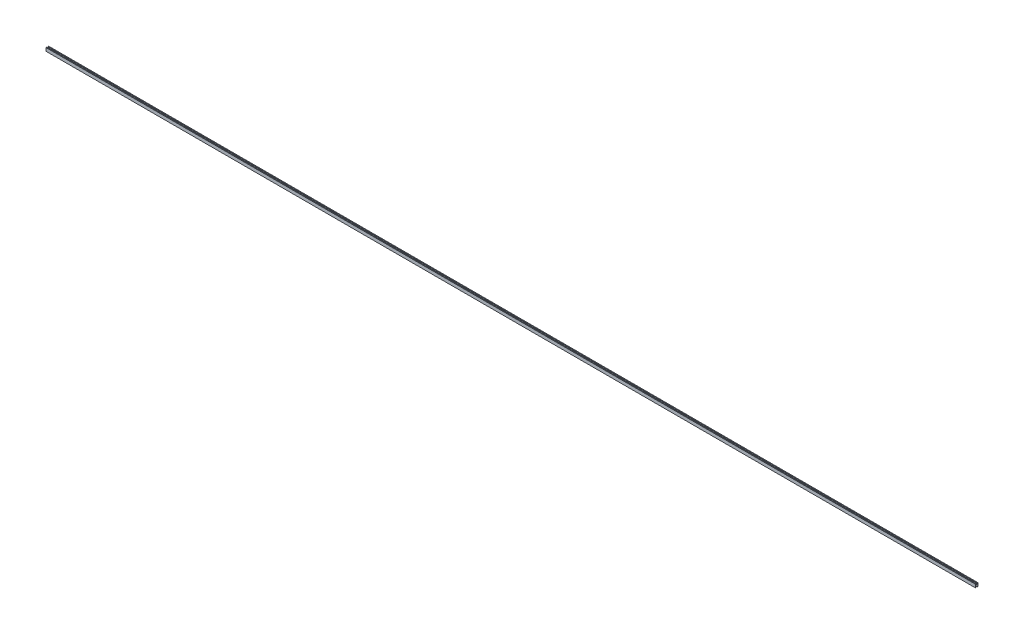
ISO-10303-21;
HEADER;
FILE_DESCRIPTION(('STEP AP214'),'2;1');
FILE_NAME('part.step','',(''),(''),'','','');
FILE_SCHEMA(('AUTOMOTIVE_DESIGN { 1 0 10303 214 1 1 1 1 }'));
ENDSEC;
DATA;
#1=APPLICATION_CONTEXT('core data for automotive mechanical design processes');
#2=APPLICATION_PROTOCOL_DEFINITION('international standard','automotive_design',2000,#1);
#3=PRODUCT_CONTEXT('',#1,'mechanical');
#4=PRODUCT('Part','Part','',(#3));
#5=PRODUCT_RELATED_PRODUCT_CATEGORY('part','',(#4));
#6=PRODUCT_DEFINITION_FORMATION('','',#4);
#7=PRODUCT_DEFINITION_CONTEXT('part definition',#1,'design');
#8=PRODUCT_DEFINITION('design','',#6,#7);
#9=PRODUCT_DEFINITION_SHAPE('','',#8);
#10=(LENGTH_UNIT() NAMED_UNIT(*) SI_UNIT(.MILLI.,.METRE.));
#11=(NAMED_UNIT(*) PLANE_ANGLE_UNIT() SI_UNIT($,.RADIAN.));
#12=(NAMED_UNIT(*) SI_UNIT($,.STERADIAN.) SOLID_ANGLE_UNIT());
#13=UNCERTAINTY_MEASURE_WITH_UNIT(LENGTH_MEASURE(1.E-05),#10,'distance_accuracy_value','');
#14=(GEOMETRIC_REPRESENTATION_CONTEXT(3) GLOBAL_UNCERTAINTY_ASSIGNED_CONTEXT((#13)) GLOBAL_UNIT_ASSIGNED_CONTEXT((#10,
#11,#12)) REPRESENTATION_CONTEXT('',''));
#15=CARTESIAN_POINT('',(0.,0.,0.));
#16=DIRECTION('',(0.,0.,1.));
#17=DIRECTION('',(1.,0.,0.));
#18=AXIS2_PLACEMENT_3D('',#15,#16,#17);
#19=CARTESIAN_POINT('',(9144.,15.875,12.7));
#20=DIRECTION('',(0.,1.,0.));
#21=DIRECTION('',(0.,0.,1.));
#22=AXIS2_PLACEMENT_3D('',#19,#20,#21);
#23=PLANE('',#22);
#24=DIRECTION('',(0.,0.,-1.));
#25=VECTOR('',#24,1.);
#26=CARTESIAN_POINT('',(0.,15.875,12.7));
#27=LINE('',#26,#25);
#28=CARTESIAN_POINT('',(0.,15.875,12.7));
#29=VERTEX_POINT('',#28);
#30=CARTESIAN_POINT('',(0.,15.875,5.08));
#31=VERTEX_POINT('',#30);
#32=EDGE_CURVE('E165',#29,#31,#27,.T.);
#33=ORIENTED_EDGE('',*,*,#32,.F.);
#34=DIRECTION('',(-1.,0.,0.));
#35=VECTOR('',#34,1.);
#36=CARTESIAN_POINT('',(9144.,15.875,12.7));
#37=LINE('',#36,#35);
#38=CARTESIAN_POINT('',(9144.,15.875,12.7));
#39=VERTEX_POINT('',#38);
#40=EDGE_CURVE('E11',#39,#29,#37,.T.);
#41=ORIENTED_EDGE('',*,*,#40,.F.);
#42=DIRECTION('',(0.,0.,-1.));
#43=VECTOR('',#42,1.);
#44=CARTESIAN_POINT('',(9144.,15.875,12.7));
#45=LINE('',#44,#43);
#46=CARTESIAN_POINT('',(9144.,15.875,5.08));
#47=VERTEX_POINT('',#46);
#48=EDGE_CURVE('E206',#39,#47,#45,.T.);
#49=ORIENTED_EDGE('',*,*,#48,.T.);
#50=DIRECTION('',(-1.,0.,0.));
#51=VECTOR('',#50,1.);
#52=CARTESIAN_POINT('',(9144.,15.875,5.08));
#53=LINE('',#52,#51);
#54=EDGE_CURVE('E42',#47,#31,#53,.T.);
#55=ORIENTED_EDGE('',*,*,#54,.T.);
#56=EDGE_LOOP('',(#33,#41,#49,#55));
#57=FACE_BOUND('',#56,.T.);
#58=ADVANCED_FACE('F39',(#57),#23,.T.);
#59=CARTESIAN_POINT('',(9144.,-15.875,12.7));
#60=DIRECTION('',(0.,0.,1.));
#61=DIRECTION('',(1.,0.,0.));
#62=AXIS2_PLACEMENT_3D('',#59,#60,#61);
#63=PLANE('',#62);
#64=DIRECTION('',(0.,1.,0.));
#65=VECTOR('',#64,1.);
#66=CARTESIAN_POINT('',(0.,-15.875,12.7));
#67=LINE('',#66,#65);
#68=CARTESIAN_POINT('',(0.,-15.875,12.7));
#69=VERTEX_POINT('',#68);
#70=EDGE_CURVE('E203',#69,#29,#67,.T.);
#71=ORIENTED_EDGE('',*,*,#70,.F.);
#72=DIRECTION('',(-1.,0.,0.));
#73=VECTOR('',#72,1.);
#74=CARTESIAN_POINT('',(9144.,-15.875,12.7));
#75=LINE('',#74,#73);
#76=CARTESIAN_POINT('',(9144.,-15.875,12.7));
#77=VERTEX_POINT('',#76);
#78=EDGE_CURVE('E49',#77,#69,#75,.T.);
#79=ORIENTED_EDGE('',*,*,#78,.F.);
#80=DIRECTION('',(0.,1.,0.));
#81=VECTOR('',#80,1.);
#82=CARTESIAN_POINT('',(9144.,-15.875,12.7));
#83=LINE('',#82,#81);
#84=EDGE_CURVE('E140',#77,#39,#83,.T.);
#85=ORIENTED_EDGE('',*,*,#84,.T.);
#86=ORIENTED_EDGE('',*,*,#40,.T.);
#87=EDGE_LOOP('',(#71,#79,#85,#86));
#88=FACE_BOUND('',#87,.T.);
#89=ADVANCED_FACE('F239',(#88),#63,.T.);
#90=CARTESIAN_POINT('',(9144.,-15.875,12.7));
#91=DIRECTION('',(0.,1.,0.));
#92=DIRECTION('',(0.,0.,1.));
#93=AXIS2_PLACEMENT_3D('',#90,#91,#92);
#94=PLANE('',#93);
#95=DIRECTION('',(0.,0.,-1.));
#96=VECTOR('',#95,1.);
#97=CARTESIAN_POINT('',(0.,-15.875,12.7));
#98=LINE('',#97,#96);
#99=CARTESIAN_POINT('',(0.,-15.875,5.08));
#100=VERTEX_POINT('',#99);
#101=EDGE_CURVE('E146',#69,#100,#98,.T.);
#102=ORIENTED_EDGE('',*,*,#101,.T.);
#103=DIRECTION('',(-1.,0.,0.));
#104=VECTOR('',#103,1.);
#105=CARTESIAN_POINT('',(9144.,-15.875,5.08));
#106=LINE('',#105,#104);
#107=CARTESIAN_POINT('',(9144.,-15.875,5.08));
#108=VERTEX_POINT('',#107);
#109=EDGE_CURVE('E144',#108,#100,#106,.T.);
#110=ORIENTED_EDGE('',*,*,#109,.F.);
#111=DIRECTION('',(0.,0.,-1.));
#112=VECTOR('',#111,1.);
#113=CARTESIAN_POINT('',(9144.,-15.875,12.7));
#114=LINE('',#113,#112);
#115=EDGE_CURVE('E134',#77,#108,#114,.T.);
#116=ORIENTED_EDGE('',*,*,#115,.F.);
#117=ORIENTED_EDGE('',*,*,#78,.T.);
#118=EDGE_LOOP('',(#102,#110,#116,#117));
#119=FACE_BOUND('',#118,.T.);
#120=ADVANCED_FACE('F145',(#119),#94,.F.);
#121=CARTESIAN_POINT('',(9144.,-15.875,5.08));
#122=DIRECTION('',(0.,0.,1.));
#123=DIRECTION('',(0.,-1.,0.));
#124=AXIS2_PLACEMENT_3D('',#121,#122,#123);
#125=PLANE('',#124);
#126=DIRECTION('',(0.,1.,0.));
#127=VECTOR('',#126,1.);
#128=CARTESIAN_POINT('',(0.,-15.875,5.08));
#129=LINE('',#128,#127);
#130=CARTESIAN_POINT('',(0.,-6.98499999999999,5.08));
#131=VERTEX_POINT('',#130);
#132=EDGE_CURVE('E198',#100,#131,#129,.T.);
#133=ORIENTED_EDGE('',*,*,#132,.T.);
#134=DIRECTION('',(-1.,0.,0.));
#135=VECTOR('',#134,1.);
#136=CARTESIAN_POINT('',(9144.,-6.98499999999999,5.08));
#137=LINE('',#136,#135);
#138=CARTESIAN_POINT('',(9144.,-6.98499999999999,5.08));
#139=VERTEX_POINT('',#138);
#140=EDGE_CURVE('E150',#139,#131,#137,.T.);
#141=ORIENTED_EDGE('',*,*,#140,.F.);
#142=DIRECTION('',(0.,1.,0.));
#143=VECTOR('',#142,1.);
#144=CARTESIAN_POINT('',(9144.,-15.875,5.08));
#145=LINE('',#144,#143);
#146=EDGE_CURVE('E138',#108,#139,#145,.T.);
#147=ORIENTED_EDGE('',*,*,#146,.F.);
#148=ORIENTED_EDGE('',*,*,#109,.T.);
#149=EDGE_LOOP('',(#133,#141,#147,#148));
#150=FACE_BOUND('',#149,.T.);
#151=ADVANCED_FACE('F152',(#150),#125,.F.);
#152=CARTESIAN_POINT('',(9144.,-6.98499999999999,5.08));
#153=DIRECTION('',(0.,1.,0.));
#154=DIRECTION('',(0.,0.,1.));
#155=AXIS2_PLACEMENT_3D('',#152,#153,#154);
#156=PLANE('',#155);
#157=DIRECTION('',(0.,0.,-1.));
#158=VECTOR('',#157,1.);
#159=CARTESIAN_POINT('',(0.,-6.98499999999999,5.08));
#160=LINE('',#159,#158);
#161=CARTESIAN_POINT('',(0.,-6.98499999999999,-5.08));
#162=VERTEX_POINT('',#161);
#163=EDGE_CURVE('E195',#131,#162,#160,.T.);
#164=ORIENTED_EDGE('',*,*,#163,.T.);
#165=DIRECTION('',(-1.,0.,0.));
#166=VECTOR('',#165,1.);
#167=CARTESIAN_POINT('',(9144.,-6.98499999999999,-5.08));
#168=LINE('',#167,#166);
#169=CARTESIAN_POINT('',(9144.,-6.98499999999999,-5.08));
#170=VERTEX_POINT('',#169);
#171=EDGE_CURVE('E212',#170,#162,#168,.T.);
#172=ORIENTED_EDGE('',*,*,#171,.F.);
#173=DIRECTION('',(0.,0.,-1.));
#174=VECTOR('',#173,1.);
#175=CARTESIAN_POINT('',(9144.,-6.98499999999999,5.08));
#176=LINE('',#175,#174);
#177=EDGE_CURVE('E156',#139,#170,#176,.T.);
#178=ORIENTED_EDGE('',*,*,#177,.F.);
#179=ORIENTED_EDGE('',*,*,#140,.T.);
#180=EDGE_LOOP('',(#164,#172,#178,#179));
#181=FACE_BOUND('',#180,.T.);
#182=ADVANCED_FACE('F252',(#181),#156,.F.);
#183=CARTESIAN_POINT('',(9144.,-6.98499999999999,-5.08));
#184=DIRECTION('',(0.,0.,-1.));
#185=DIRECTION('',(-1.,0.,0.));
#186=AXIS2_PLACEMENT_3D('',#183,#184,#185);
#187=PLANE('',#186);
#188=DIRECTION('',(0.,-1.,0.));
#189=VECTOR('',#188,1.);
#190=CARTESIAN_POINT('',(0.,-6.98499999999999,-5.08));
#191=LINE('',#190,#189);
#192=CARTESIAN_POINT('',(0.,-15.875,-5.08));
#193=VERTEX_POINT('',#192);
#194=EDGE_CURVE('E192',#162,#193,#191,.T.);
#195=ORIENTED_EDGE('',*,*,#194,.T.);
#196=DIRECTION('',(-1.,0.,0.));
#197=VECTOR('',#196,1.);
#198=CARTESIAN_POINT('',(9144.,-15.875,-5.08));
#199=LINE('',#198,#197);
#200=CARTESIAN_POINT('',(9144.,-15.875,-5.08));
#201=VERTEX_POINT('',#200);
#202=EDGE_CURVE('E216',#201,#193,#199,.T.);
#203=ORIENTED_EDGE('',*,*,#202,.F.);
#204=DIRECTION('',(0.,-1.,0.));
#205=VECTOR('',#204,1.);
#206=CARTESIAN_POINT('',(9144.,-6.98499999999999,-5.08));
#207=LINE('',#206,#205);
#208=EDGE_CURVE('E159',#170,#201,#207,.T.);
#209=ORIENTED_EDGE('',*,*,#208,.F.);
#210=ORIENTED_EDGE('',*,*,#171,.T.);
#211=EDGE_LOOP('',(#195,#203,#209,#210));
#212=FACE_BOUND('',#211,.T.);
#213=ADVANCED_FACE('F255',(#212),#187,.F.);
#214=CARTESIAN_POINT('',(9144.,-15.875,-5.08));
#215=DIRECTION('',(0.,1.,0.));
#216=DIRECTION('',(0.,0.,1.));
#217=AXIS2_PLACEMENT_3D('',#214,#215,#216);
#218=PLANE('',#217);
#219=DIRECTION('',(0.,0.,-1.));
#220=VECTOR('',#219,1.);
#221=CARTESIAN_POINT('',(0.,-15.875,-5.08));
#222=LINE('',#221,#220);
#223=CARTESIAN_POINT('',(0.,-15.875,-12.7));
#224=VERTEX_POINT('',#223);
#225=EDGE_CURVE('E189',#193,#224,#222,.T.);
#226=ORIENTED_EDGE('',*,*,#225,.T.);
#227=DIRECTION('',(-1.,0.,0.));
#228=VECTOR('',#227,1.);
#229=CARTESIAN_POINT('',(9144.,-15.875,-12.7));
#230=LINE('',#229,#228);
#231=CARTESIAN_POINT('',(9144.,-15.875,-12.7));
#232=VERTEX_POINT('',#231);
#233=EDGE_CURVE('E220',#232,#224,#230,.T.);
#234=ORIENTED_EDGE('',*,*,#233,.F.);
#235=DIRECTION('',(0.,0.,-1.));
#236=VECTOR('',#235,1.);
#237=CARTESIAN_POINT('',(9144.,-15.875,-5.08));
#238=LINE('',#237,#236);
#239=EDGE_CURVE('E383',#201,#232,#238,.T.);
#240=ORIENTED_EDGE('',*,*,#239,.F.);
#241=ORIENTED_EDGE('',*,*,#202,.T.);
#242=EDGE_LOOP('',(#226,#234,#240,#241));
#243=FACE_BOUND('',#242,.T.);
#244=ADVANCED_FACE('F259',(#243),#218,.F.);
#245=CARTESIAN_POINT('',(9144.,-15.875,-12.7));
#246=DIRECTION('',(0.,0.,1.));
#247=DIRECTION('',(1.,0.,0.));
#248=AXIS2_PLACEMENT_3D('',#245,#246,#247);
#249=PLANE('',#248);
#250=DIRECTION('',(0.,1.,0.));
#251=VECTOR('',#250,1.);
#252=CARTESIAN_POINT('',(0.,-15.875,-12.7));
#253=LINE('',#252,#251);
#254=CARTESIAN_POINT('',(0.,15.875,-12.7));
#255=VERTEX_POINT('',#254);
#256=EDGE_CURVE('E185',#224,#255,#253,.T.);
#257=ORIENTED_EDGE('',*,*,#256,.T.);
#258=DIRECTION('',(-1.,0.,0.));
#259=VECTOR('',#258,1.);
#260=CARTESIAN_POINT('',(9144.,15.875,-12.7));
#261=LINE('',#260,#259);
#262=CARTESIAN_POINT('',(9144.,15.875,-12.7));
#263=VERTEX_POINT('',#262);
#264=EDGE_CURVE('E224',#263,#255,#261,.T.);
#265=ORIENTED_EDGE('',*,*,#264,.F.);
#266=DIRECTION('',(0.,1.,0.));
#267=VECTOR('',#266,1.);
#268=CARTESIAN_POINT('',(9144.,-15.875,-12.7));
#269=LINE('',#268,#267);
#270=EDGE_CURVE('E388',#232,#263,#269,.T.);
#271=ORIENTED_EDGE('',*,*,#270,.F.);
#272=ORIENTED_EDGE('',*,*,#233,.T.);
#273=EDGE_LOOP('',(#257,#265,#271,#272));
#274=FACE_BOUND('',#273,.T.);
#275=ADVANCED_FACE('F263',(#274),#249,.F.);
#276=CARTESIAN_POINT('',(9144.,15.875,-5.08));
#277=DIRECTION('',(0.,1.,0.));
#278=DIRECTION('',(0.,0.,1.));
#279=AXIS2_PLACEMENT_3D('',#276,#277,#278);
#280=PLANE('',#279);
#281=DIRECTION('',(0.,0.,-1.));
#282=VECTOR('',#281,1.);
#283=CARTESIAN_POINT('',(0.,15.875,-5.08));
#284=LINE('',#283,#282);
#285=CARTESIAN_POINT('',(0.,15.875,-5.08));
#286=VERTEX_POINT('',#285);
#287=EDGE_CURVE('E181',#286,#255,#284,.T.);
#288=ORIENTED_EDGE('',*,*,#287,.F.);
#289=DIRECTION('',(-1.,0.,0.));
#290=VECTOR('',#289,1.);
#291=CARTESIAN_POINT('',(9144.,15.875,-5.08));
#292=LINE('',#291,#290);
#293=CARTESIAN_POINT('',(9144.,15.875,-5.08));
#294=VERTEX_POINT('',#293);
#295=EDGE_CURVE('E227',#294,#286,#292,.T.);
#296=ORIENTED_EDGE('',*,*,#295,.F.);
#297=DIRECTION('',(0.,0.,-1.));
#298=VECTOR('',#297,1.);
#299=CARTESIAN_POINT('',(9144.,15.875,-5.08));
#300=LINE('',#299,#298);
#301=EDGE_CURVE('E375',#294,#263,#300,.T.);
#302=ORIENTED_EDGE('',*,*,#301,.T.);
#303=ORIENTED_EDGE('',*,*,#264,.T.);
#304=EDGE_LOOP('',(#288,#296,#302,#303));
#305=FACE_BOUND('',#304,.T.);
#306=ADVANCED_FACE('F267',(#305),#280,.T.);
#307=CARTESIAN_POINT('',(9144.,6.98499999999999,-5.08));
#308=DIRECTION('',(0.,0.,1.));
#309=DIRECTION('',(1.,0.,0.));
#310=AXIS2_PLACEMENT_3D('',#307,#308,#309);
#311=PLANE('',#310);
#312=DIRECTION('',(0.,1.,0.));
#313=VECTOR('',#312,1.);
#314=CARTESIAN_POINT('',(0.,6.98499999999999,-5.08));
#315=LINE('',#314,#313);
#316=CARTESIAN_POINT('',(0.,6.98499999999999,-5.08));
#317=VERTEX_POINT('',#316);
#318=EDGE_CURVE('E177',#317,#286,#315,.T.);
#319=ORIENTED_EDGE('',*,*,#318,.F.);
#320=DIRECTION('',(-1.,0.,0.));
#321=VECTOR('',#320,1.);
#322=CARTESIAN_POINT('',(9144.,6.98499999999999,-5.08));
#323=LINE('',#322,#321);
#324=CARTESIAN_POINT('',(9144.,6.98499999999999,-5.08));
#325=VERTEX_POINT('',#324);
#326=EDGE_CURVE('E230',#325,#317,#323,.T.);
#327=ORIENTED_EDGE('',*,*,#326,.F.);
#328=DIRECTION('',(0.,1.,0.));
#329=VECTOR('',#328,1.);
#330=CARTESIAN_POINT('',(9144.,6.98499999999999,-5.08));
#331=LINE('',#330,#329);
#332=EDGE_CURVE('E371',#325,#294,#331,.T.);
#333=ORIENTED_EDGE('',*,*,#332,.T.);
#334=ORIENTED_EDGE('',*,*,#295,.T.);
#335=EDGE_LOOP('',(#319,#327,#333,#334));
#336=FACE_BOUND('',#335,.T.);
#337=ADVANCED_FACE('F271',(#336),#311,.T.);
#338=CARTESIAN_POINT('',(9144.,6.98499999999999,5.08));
#339=DIRECTION('',(0.,1.,0.));
#340=DIRECTION('',(0.,0.,1.));
#341=AXIS2_PLACEMENT_3D('',#338,#339,#340);
#342=PLANE('',#341);
#343=DIRECTION('',(0.,0.,-1.));
#344=VECTOR('',#343,1.);
#345=CARTESIAN_POINT('',(0.,6.98499999999999,5.08));
#346=LINE('',#345,#344);
#347=CARTESIAN_POINT('',(0.,6.98499999999999,5.08));
#348=VERTEX_POINT('',#347);
#349=EDGE_CURVE('E173',#348,#317,#346,.T.);
#350=ORIENTED_EDGE('',*,*,#349,.F.);
#351=DIRECTION('',(-1.,0.,0.));
#352=VECTOR('',#351,1.);
#353=CARTESIAN_POINT('',(9144.,6.98499999999999,5.08));
#354=LINE('',#353,#352);
#355=CARTESIAN_POINT('',(9144.,6.98499999999999,5.08));
#356=VERTEX_POINT('',#355);
#357=EDGE_CURVE('E232',#356,#348,#354,.T.);
#358=ORIENTED_EDGE('',*,*,#357,.F.);
#359=DIRECTION('',(0.,0.,-1.));
#360=VECTOR('',#359,1.);
#361=CARTESIAN_POINT('',(9144.,6.98499999999999,5.08));
#362=LINE('',#361,#360);
#363=EDGE_CURVE('E397',#356,#325,#362,.T.);
#364=ORIENTED_EDGE('',*,*,#363,.T.);
#365=ORIENTED_EDGE('',*,*,#326,.T.);
#366=EDGE_LOOP('',(#350,#358,#364,#365));
#367=FACE_BOUND('',#366,.T.);
#368=ADVANCED_FACE('F275',(#367),#342,.T.);
#369=CARTESIAN_POINT('',(9144.,15.875,5.08));
#370=DIRECTION('',(0.,0.,-1.));
#371=DIRECTION('',(0.,1.,0.));
#372=AXIS2_PLACEMENT_3D('',#369,#370,#371);
#373=PLANE('',#372);
#374=DIRECTION('',(0.,-1.,0.));
#375=VECTOR('',#374,1.);
#376=CARTESIAN_POINT('',(0.,15.875,5.08));
#377=LINE('',#376,#375);
#378=EDGE_CURVE('E169',#31,#348,#377,.T.);
#379=ORIENTED_EDGE('',*,*,#378,.F.);
#380=ORIENTED_EDGE('',*,*,#54,.F.);
#381=DIRECTION('',(0.,-1.,0.));
#382=VECTOR('',#381,1.);
#383=CARTESIAN_POINT('',(9144.,15.875,5.08));
#384=LINE('',#383,#382);
#385=EDGE_CURVE('E400',#47,#356,#384,.T.);
#386=ORIENTED_EDGE('',*,*,#385,.T.);
#387=ORIENTED_EDGE('',*,*,#357,.T.);
#388=EDGE_LOOP('',(#379,#380,#386,#387));
#389=FACE_BOUND('',#388,.T.);
#390=ADVANCED_FACE('F236',(#389),#373,.T.);
#391=CARTESIAN_POINT('',(9144.,0.,0.));
#392=DIRECTION('',(-1.,0.,0.));
#393=DIRECTION('',(0.,0.,1.));
#394=AXIS2_PLACEMENT_3D('',#391,#392,#393);
#395=PLANE('',#394);
#396=ORIENTED_EDGE('',*,*,#48,.F.);
#397=ORIENTED_EDGE('',*,*,#84,.F.);
#398=ORIENTED_EDGE('',*,*,#115,.T.);
#399=ORIENTED_EDGE('',*,*,#146,.T.);
#400=ORIENTED_EDGE('',*,*,#177,.T.);
#401=ORIENTED_EDGE('',*,*,#208,.T.);
#402=ORIENTED_EDGE('',*,*,#239,.T.);
#403=ORIENTED_EDGE('',*,*,#270,.T.);
#404=ORIENTED_EDGE('',*,*,#301,.F.);
#405=ORIENTED_EDGE('',*,*,#332,.F.);
#406=ORIENTED_EDGE('',*,*,#363,.F.);
#407=ORIENTED_EDGE('',*,*,#385,.F.);
#408=EDGE_LOOP('',(#396,#397,#398,#399,#400,#401,#402,#403,#404,#405,#406,#407));
#409=FACE_BOUND('',#408,.T.);
#410=ADVANCED_FACE('F136',(#409),#395,.F.);
#411=CARTESIAN_POINT('',(0.,0.,0.));
#412=DIRECTION('',(-1.,0.,0.));
#413=DIRECTION('',(0.,0.,1.));
#414=AXIS2_PLACEMENT_3D('',#411,#412,#413);
#415=PLANE('',#414);
#416=ORIENTED_EDGE('',*,*,#32,.T.);
#417=ORIENTED_EDGE('',*,*,#378,.T.);
#418=ORIENTED_EDGE('',*,*,#349,.T.);
#419=ORIENTED_EDGE('',*,*,#318,.T.);
#420=ORIENTED_EDGE('',*,*,#287,.T.);
#421=ORIENTED_EDGE('',*,*,#256,.F.);
#422=ORIENTED_EDGE('',*,*,#225,.F.);
#423=ORIENTED_EDGE('',*,*,#194,.F.);
#424=ORIENTED_EDGE('',*,*,#163,.F.);
#425=ORIENTED_EDGE('',*,*,#132,.F.);
#426=ORIENTED_EDGE('',*,*,#101,.F.);
#427=ORIENTED_EDGE('',*,*,#70,.T.);
#428=EDGE_LOOP('',(#416,#417,#418,#419,#420,#421,#422,#423,#424,#425,#426,#427));
#429=FACE_BOUND('',#428,.T.);
#430=ADVANCED_FACE('F238',(#429),#415,.T.);
#431=CLOSED_SHELL('',(#58,#89,#120,#151,#182,#213,#244,#275,#306,#337,#368,#390,#410,#430));
#432=MANIFOLD_SOLID_BREP('B2',#431);
#433=ADVANCED_BREP_SHAPE_REPRESENTATION('',(#18,#432),#14);
#434=SHAPE_DEFINITION_REPRESENTATION(#9,#433);
ENDSEC;
END-ISO-10303-21;
